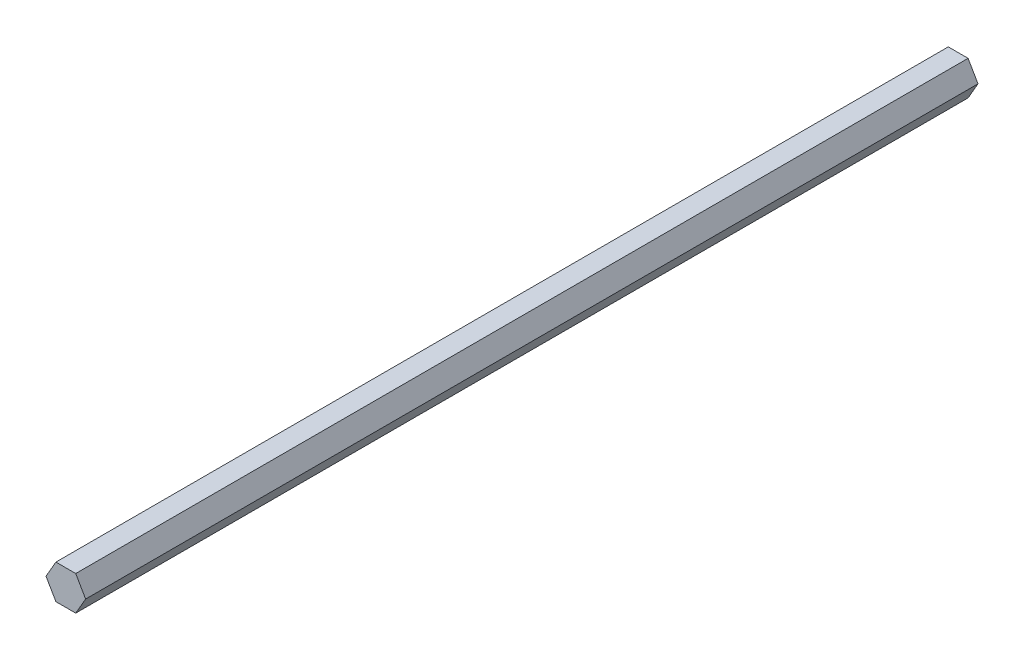
ISO-10303-21;
HEADER;
FILE_DESCRIPTION(('STEP AP214'),'2;1');
FILE_NAME('part.step','',(''),(''),'','','');
FILE_SCHEMA(('AUTOMOTIVE_DESIGN { 1 0 10303 214 1 1 1 1 }'));
ENDSEC;
DATA;
#1=APPLICATION_CONTEXT('core data for automotive mechanical design processes');
#2=APPLICATION_PROTOCOL_DEFINITION('international standard','automotive_design',2000,#1);
#3=PRODUCT_CONTEXT('',#1,'mechanical');
#4=PRODUCT('Part','Part','',(#3));
#5=PRODUCT_RELATED_PRODUCT_CATEGORY('part','',(#4));
#6=PRODUCT_DEFINITION_FORMATION('','',#4);
#7=PRODUCT_DEFINITION_CONTEXT('part definition',#1,'design');
#8=PRODUCT_DEFINITION('design','',#6,#7);
#9=PRODUCT_DEFINITION_SHAPE('','',#8);
#10=(LENGTH_UNIT() NAMED_UNIT(*) SI_UNIT(.MILLI.,.METRE.));
#11=(NAMED_UNIT(*) PLANE_ANGLE_UNIT() SI_UNIT($,.RADIAN.));
#12=(NAMED_UNIT(*) SI_UNIT($,.STERADIAN.) SOLID_ANGLE_UNIT());
#13=UNCERTAINTY_MEASURE_WITH_UNIT(LENGTH_MEASURE(1.E-05),#10,'distance_accuracy_value','');
#14=(GEOMETRIC_REPRESENTATION_CONTEXT(3) GLOBAL_UNCERTAINTY_ASSIGNED_CONTEXT((#13)) GLOBAL_UNIT_ASSIGNED_CONTEXT((#10,
#11,#12)) REPRESENTATION_CONTEXT('',''));
#15=CARTESIAN_POINT('',(0.,0.,0.));
#16=DIRECTION('',(0.,0.,1.));
#17=DIRECTION('',(1.,0.,0.));
#18=AXIS2_PLACEMENT_3D('',#15,#16,#17);
#19=CARTESIAN_POINT('',(3.66617420935412,6.35,330.2));
#20=DIRECTION('',(0.,-1.,0.));
#21=DIRECTION('',(1.,0.,0.));
#22=AXIS2_PLACEMENT_3D('',#19,#20,#21);
#23=PLANE('',#22);
#24=DIRECTION('',(-1.,0.,0.));
#25=VECTOR('',#24,1.);
#26=CARTESIAN_POINT('',(3.66617420935412,6.35,0.));
#27=LINE('',#26,#25);
#28=CARTESIAN_POINT('',(3.66617420935412,6.35,0.));
#29=VERTEX_POINT('',#28);
#30=CARTESIAN_POINT('',(-3.66617420935412,6.35,0.));
#31=VERTEX_POINT('',#30);
#32=EDGE_CURVE('E117',#29,#31,#27,.T.);
#33=ORIENTED_EDGE('',*,*,#32,.T.);
#34=DIRECTION('',(0.,0.,-1.));
#35=VECTOR('',#34,1.);
#36=CARTESIAN_POINT('',(-3.66617420935412,6.35,330.2));
#37=LINE('',#36,#35);
#38=CARTESIAN_POINT('',(-3.66617420935412,6.35,330.2));
#39=VERTEX_POINT('',#38);
#40=EDGE_CURVE('E11',#39,#31,#37,.T.);
#41=ORIENTED_EDGE('',*,*,#40,.F.);
#42=DIRECTION('',(-1.,0.,0.));
#43=VECTOR('',#42,1.);
#44=CARTESIAN_POINT('',(3.66617420935412,6.35,330.2));
#45=LINE('',#44,#43);
#46=CARTESIAN_POINT('',(3.66617420935412,6.35,330.2));
#47=VERTEX_POINT('',#46);
#48=EDGE_CURVE('E127',#47,#39,#45,.T.);
#49=ORIENTED_EDGE('',*,*,#48,.F.);
#50=DIRECTION('',(0.,0.,-1.));
#51=VECTOR('',#50,1.);
#52=CARTESIAN_POINT('',(3.66617420935412,6.35,330.2));
#53=LINE('',#52,#51);
#54=EDGE_CURVE('E113',#47,#29,#53,.T.);
#55=ORIENTED_EDGE('',*,*,#54,.T.);
#56=EDGE_LOOP('',(#33,#41,#49,#55));
#57=FACE_BOUND('',#56,.T.);
#58=ADVANCED_FACE('F33',(#57),#23,.F.);
#59=CARTESIAN_POINT('',(-3.66617420935412,6.35,330.2));
#60=DIRECTION('',(0.866025403784439,-0.5,0.));
#61=DIRECTION('',(0.5,0.866025403784439,0.));
#62=AXIS2_PLACEMENT_3D('',#59,#60,#61);
#63=PLANE('',#62);
#64=DIRECTION('',(-0.5,-0.866025403784439,0.));
#65=VECTOR('',#64,1.);
#66=CARTESIAN_POINT('',(-3.66617420935412,6.35,0.));
#67=LINE('',#66,#65);
#68=CARTESIAN_POINT('',(-7.33234841870825,0.,0.));
#69=VERTEX_POINT('',#68);
#70=EDGE_CURVE('E120',#31,#69,#67,.T.);
#71=ORIENTED_EDGE('',*,*,#70,.T.);
#72=DIRECTION('',(0.,0.,-1.));
#73=VECTOR('',#72,1.);
#74=CARTESIAN_POINT('',(-7.33234841870825,0.,330.2));
#75=LINE('',#74,#73);
#76=CARTESIAN_POINT('',(-7.33234841870825,0.,330.2));
#77=VERTEX_POINT('',#76);
#78=EDGE_CURVE('E41',#77,#69,#75,.T.);
#79=ORIENTED_EDGE('',*,*,#78,.F.);
#80=DIRECTION('',(-0.5,-0.866025403784439,0.));
#81=VECTOR('',#80,1.);
#82=CARTESIAN_POINT('',(-3.66617420935412,6.35,330.2));
#83=LINE('',#82,#81);
#84=EDGE_CURVE('E86',#39,#77,#83,.T.);
#85=ORIENTED_EDGE('',*,*,#84,.F.);
#86=ORIENTED_EDGE('',*,*,#40,.T.);
#87=EDGE_LOOP('',(#71,#79,#85,#86));
#88=FACE_BOUND('',#87,.T.);
#89=ADVANCED_FACE('F151',(#88),#63,.F.);
#90=CARTESIAN_POINT('',(-7.33234841870825,0.,330.2));
#91=DIRECTION('',(0.866025403784438,0.5,0.));
#92=DIRECTION('',(-0.5,0.866025403784439,0.));
#93=AXIS2_PLACEMENT_3D('',#90,#91,#92);
#94=PLANE('',#93);
#95=DIRECTION('',(0.5,-0.866025403784439,0.));
#96=VECTOR('',#95,1.);
#97=CARTESIAN_POINT('',(-7.33234841870825,0.,0.));
#98=LINE('',#97,#96);
#99=CARTESIAN_POINT('',(-3.66617420935412,-6.35,0.));
#100=VERTEX_POINT('',#99);
#101=EDGE_CURVE('E122',#69,#100,#98,.T.);
#102=ORIENTED_EDGE('',*,*,#101,.T.);
#103=DIRECTION('',(0.,0.,-1.));
#104=VECTOR('',#103,1.);
#105=CARTESIAN_POINT('',(-3.66617420935412,-6.35,330.2));
#106=LINE('',#105,#104);
#107=CARTESIAN_POINT('',(-3.66617420935412,-6.35,330.2));
#108=VERTEX_POINT('',#107);
#109=EDGE_CURVE('E108',#108,#100,#106,.T.);
#110=ORIENTED_EDGE('',*,*,#109,.F.);
#111=DIRECTION('',(0.5,-0.866025403784439,0.));
#112=VECTOR('',#111,1.);
#113=CARTESIAN_POINT('',(-7.33234841870825,0.,330.2));
#114=LINE('',#113,#112);
#115=EDGE_CURVE('E99',#77,#108,#114,.T.);
#116=ORIENTED_EDGE('',*,*,#115,.F.);
#117=ORIENTED_EDGE('',*,*,#78,.T.);
#118=EDGE_LOOP('',(#102,#110,#116,#117));
#119=FACE_BOUND('',#118,.T.);
#120=ADVANCED_FACE('F133',(#119),#94,.F.);
#121=CARTESIAN_POINT('',(-3.66617420935412,-6.35,330.2));
#122=DIRECTION('',(0.,1.,0.));
#123=DIRECTION('',(-1.,0.,0.));
#124=AXIS2_PLACEMENT_3D('',#121,#122,#123);
#125=PLANE('',#124);
#126=DIRECTION('',(1.,0.,0.));
#127=VECTOR('',#126,1.);
#128=CARTESIAN_POINT('',(-3.66617420935412,-6.35,0.));
#129=LINE('',#128,#127);
#130=CARTESIAN_POINT('',(3.66617420935413,-6.35,0.));
#131=VERTEX_POINT('',#130);
#132=EDGE_CURVE('E107',#100,#131,#129,.T.);
#133=ORIENTED_EDGE('',*,*,#132,.T.);
#134=DIRECTION('',(0.,0.,-1.));
#135=VECTOR('',#134,1.);
#136=CARTESIAN_POINT('',(3.66617420935413,-6.35,330.2));
#137=LINE('',#136,#135);
#138=CARTESIAN_POINT('',(3.66617420935413,-6.35,330.2));
#139=VERTEX_POINT('',#138);
#140=EDGE_CURVE('E104',#139,#131,#137,.T.);
#141=ORIENTED_EDGE('',*,*,#140,.F.);
#142=DIRECTION('',(1.,0.,0.));
#143=VECTOR('',#142,1.);
#144=CARTESIAN_POINT('',(-3.66617420935412,-6.35,330.2));
#145=LINE('',#144,#143);
#146=EDGE_CURVE('E93',#108,#139,#145,.T.);
#147=ORIENTED_EDGE('',*,*,#146,.F.);
#148=ORIENTED_EDGE('',*,*,#109,.T.);
#149=EDGE_LOOP('',(#133,#141,#147,#148));
#150=FACE_BOUND('',#149,.T.);
#151=ADVANCED_FACE('F105',(#150),#125,.F.);
#152=CARTESIAN_POINT('',(3.66617420935413,-6.35,330.2));
#153=DIRECTION('',(-0.866025403784439,0.5,0.));
#154=DIRECTION('',(-0.5,-0.866025403784439,0.));
#155=AXIS2_PLACEMENT_3D('',#152,#153,#154);
#156=PLANE('',#155);
#157=DIRECTION('',(0.5,0.866025403784439,0.));
#158=VECTOR('',#157,1.);
#159=CARTESIAN_POINT('',(3.66617420935413,-6.35,0.));
#160=LINE('',#159,#158);
#161=CARTESIAN_POINT('',(7.33234841870825,0.,0.));
#162=VERTEX_POINT('',#161);
#163=EDGE_CURVE('E72',#131,#162,#160,.T.);
#164=ORIENTED_EDGE('',*,*,#163,.T.);
#165=DIRECTION('',(0.,0.,-1.));
#166=VECTOR('',#165,1.);
#167=CARTESIAN_POINT('',(7.33234841870825,0.,330.2));
#168=LINE('',#167,#166);
#169=CARTESIAN_POINT('',(7.33234841870825,0.,330.2));
#170=VERTEX_POINT('',#169);
#171=EDGE_CURVE('E109',#170,#162,#168,.T.);
#172=ORIENTED_EDGE('',*,*,#171,.F.);
#173=DIRECTION('',(0.5,0.866025403784439,0.));
#174=VECTOR('',#173,1.);
#175=CARTESIAN_POINT('',(3.66617420935413,-6.35,330.2));
#176=LINE('',#175,#174);
#177=EDGE_CURVE('E97',#139,#170,#176,.T.);
#178=ORIENTED_EDGE('',*,*,#177,.F.);
#179=ORIENTED_EDGE('',*,*,#140,.T.);
#180=EDGE_LOOP('',(#164,#172,#178,#179));
#181=FACE_BOUND('',#180,.T.);
#182=ADVANCED_FACE('F111',(#181),#156,.F.);
#183=CARTESIAN_POINT('',(7.33234841870825,0.,330.2));
#184=DIRECTION('',(-0.866025403784438,-0.5,0.));
#185=DIRECTION('',(0.5,-0.866025403784439,0.));
#186=AXIS2_PLACEMENT_3D('',#183,#184,#185);
#187=PLANE('',#186);
#188=DIRECTION('',(-0.5,0.866025403784438,0.));
#189=VECTOR('',#188,1.);
#190=CARTESIAN_POINT('',(7.33234841870825,0.,0.));
#191=LINE('',#190,#189);
#192=EDGE_CURVE('E78',#162,#29,#191,.T.);
#193=ORIENTED_EDGE('',*,*,#192,.T.);
#194=ORIENTED_EDGE('',*,*,#54,.F.);
#195=DIRECTION('',(-0.5,0.866025403784438,0.));
#196=VECTOR('',#195,1.);
#197=CARTESIAN_POINT('',(7.33234841870825,0.,330.2));
#198=LINE('',#197,#196);
#199=EDGE_CURVE('E49',#170,#47,#198,.T.);
#200=ORIENTED_EDGE('',*,*,#199,.F.);
#201=ORIENTED_EDGE('',*,*,#171,.T.);
#202=EDGE_LOOP('',(#193,#194,#200,#201));
#203=FACE_BOUND('',#202,.T.);
#204=ADVANCED_FACE('F140',(#203),#187,.F.);
#205=CARTESIAN_POINT('',(0.,0.,330.2));
#206=DIRECTION('',(0.,0.,1.));
#207=DIRECTION('',(1.,0.,0.));
#208=AXIS2_PLACEMENT_3D('',#205,#206,#207);
#209=PLANE('',#208);
#210=ORIENTED_EDGE('',*,*,#48,.T.);
#211=ORIENTED_EDGE('',*,*,#84,.T.);
#212=ORIENTED_EDGE('',*,*,#115,.T.);
#213=ORIENTED_EDGE('',*,*,#146,.T.);
#214=ORIENTED_EDGE('',*,*,#177,.T.);
#215=ORIENTED_EDGE('',*,*,#199,.T.);
#216=EDGE_LOOP('',(#210,#211,#212,#213,#214,#215));
#217=FACE_BOUND('',#216,.T.);
#218=ADVANCED_FACE('F95',(#217),#209,.T.);
#219=CARTESIAN_POINT('',(0.,0.,0.));
#220=DIRECTION('',(0.,0.,1.));
#221=DIRECTION('',(1.,0.,0.));
#222=AXIS2_PLACEMENT_3D('',#219,#220,#221);
#223=PLANE('',#222);
#224=ORIENTED_EDGE('',*,*,#32,.F.);
#225=ORIENTED_EDGE('',*,*,#192,.F.);
#226=ORIENTED_EDGE('',*,*,#163,.F.);
#227=ORIENTED_EDGE('',*,*,#132,.F.);
#228=ORIENTED_EDGE('',*,*,#101,.F.);
#229=ORIENTED_EDGE('',*,*,#70,.F.);
#230=EDGE_LOOP('',(#224,#225,#226,#227,#228,#229));
#231=FACE_BOUND('',#230,.T.);
#232=ADVANCED_FACE('F136',(#231),#223,.F.);
#233=CLOSED_SHELL('',(#58,#89,#120,#151,#182,#204,#218,#232));
#234=MANIFOLD_SOLID_BREP('B2',#233);
#235=ADVANCED_BREP_SHAPE_REPRESENTATION('',(#18,#234),#14);
#236=SHAPE_DEFINITION_REPRESENTATION(#9,#235);
ENDSEC;
END-ISO-10303-21;
